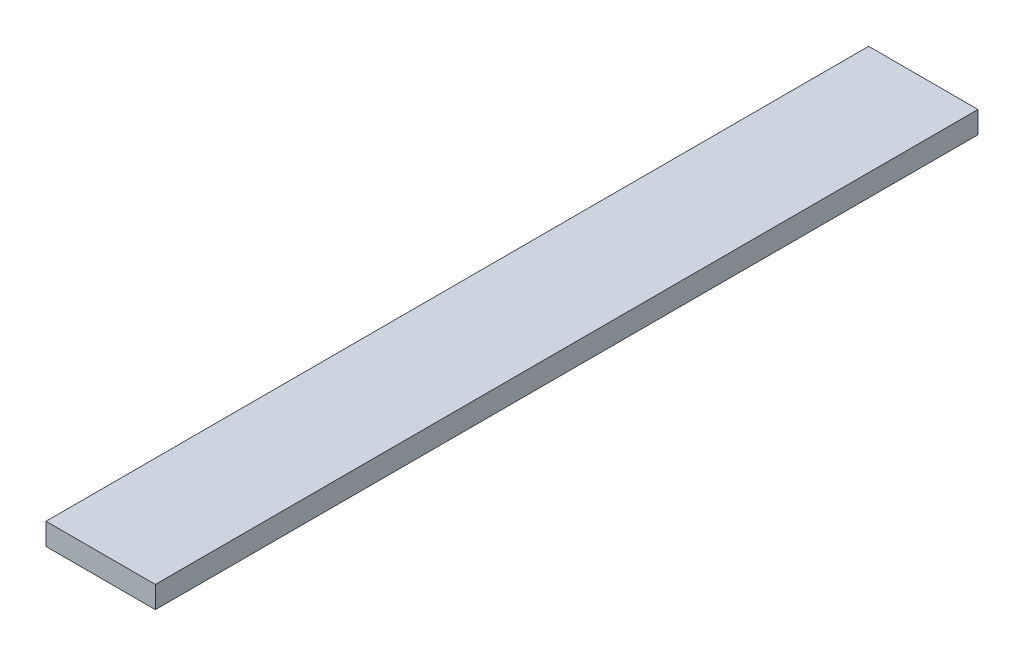
ISO-10303-21;
HEADER;
FILE_DESCRIPTION(('STEP AP214'),'2;1');
FILE_NAME('part.step','',(''),(''),'','','');
FILE_SCHEMA(('AUTOMOTIVE_DESIGN { 1 0 10303 214 1 1 1 1 }'));
ENDSEC;
DATA;
#1=APPLICATION_CONTEXT('core data for automotive mechanical design processes');
#2=APPLICATION_PROTOCOL_DEFINITION('international standard','automotive_design',2000,#1);
#3=PRODUCT_CONTEXT('',#1,'mechanical');
#4=PRODUCT('Part','Part','',(#3));
#5=PRODUCT_RELATED_PRODUCT_CATEGORY('part','',(#4));
#6=PRODUCT_DEFINITION_FORMATION('','',#4);
#7=PRODUCT_DEFINITION_CONTEXT('part definition',#1,'design');
#8=PRODUCT_DEFINITION('design','',#6,#7);
#9=PRODUCT_DEFINITION_SHAPE('','',#8);
#10=(LENGTH_UNIT() NAMED_UNIT(*) SI_UNIT(.MILLI.,.METRE.));
#11=(NAMED_UNIT(*) PLANE_ANGLE_UNIT() SI_UNIT($,.RADIAN.));
#12=(NAMED_UNIT(*) SI_UNIT($,.STERADIAN.) SOLID_ANGLE_UNIT());
#13=UNCERTAINTY_MEASURE_WITH_UNIT(LENGTH_MEASURE(1.E-05),#10,'distance_accuracy_value','');
#14=(GEOMETRIC_REPRESENTATION_CONTEXT(3) GLOBAL_UNCERTAINTY_ASSIGNED_CONTEXT((#13)) GLOBAL_UNIT_ASSIGNED_CONTEXT((#10,
#11,#12)) REPRESENTATION_CONTEXT('',''));
#15=CARTESIAN_POINT('',(0.,0.,0.));
#16=DIRECTION('',(0.,0.,1.));
#17=DIRECTION('',(1.,0.,0.));
#18=AXIS2_PLACEMENT_3D('',#15,#16,#17);
#19=CARTESIAN_POINT('',(0.,1.42999999999,0.));
#20=DIRECTION('',(0.,-1.,0.));
#21=DIRECTION('',(1.,0.,0.));
#22=AXIS2_PLACEMENT_3D('',#19,#20,#21);
#23=PLANE('',#22);
#24=DIRECTION('',(0.,0.,1.));
#25=VECTOR('',#24,1.);
#26=CARTESIAN_POINT('',(2.125,1.42999999999,0.195));
#27=LINE('',#26,#25);
#28=CARTESIAN_POINT('',(2.125,1.42999999999,0.195));
#29=VERTEX_POINT('',#28);
#30=CARTESIAN_POINT('',(2.125,1.42999999999,2.075));
#31=VERTEX_POINT('',#30);
#32=EDGE_CURVE('E80',#29,#31,#27,.T.);
#33=ORIENTED_EDGE('',*,*,#32,.T.);
#34=DIRECTION('',(-1.,0.,0.));
#35=VECTOR('',#34,1.);
#36=CARTESIAN_POINT('',(2.375,1.42999999999,2.075));
#37=LINE('',#36,#35);
#38=CARTESIAN_POINT('',(2.375,1.42999999999,2.075));
#39=VERTEX_POINT('',#38);
#40=EDGE_CURVE('E67',#31,#39,#37,.F.);
#41=ORIENTED_EDGE('',*,*,#40,.T.);
#42=DIRECTION('',(0.,0.,1.));
#43=VECTOR('',#42,1.);
#44=CARTESIAN_POINT('',(2.375,1.42999999999,0.195));
#45=LINE('',#44,#43);
#46=CARTESIAN_POINT('',(2.375,1.42999999999,0.195));
#47=VERTEX_POINT('',#46);
#48=EDGE_CURVE('E54',#39,#47,#45,.F.);
#49=ORIENTED_EDGE('',*,*,#48,.T.);
#50=DIRECTION('',(1.,0.,0.));
#51=VECTOR('',#50,1.);
#52=CARTESIAN_POINT('',(2.375,1.42999999999,0.195));
#53=LINE('',#52,#51);
#54=EDGE_CURVE('E19',#47,#29,#53,.F.);
#55=ORIENTED_EDGE('',*,*,#54,.T.);
#56=EDGE_LOOP('',(#33,#41,#49,#55));
#57=FACE_BOUND('',#56,.T.);
#58=ADVANCED_FACE('F16',(#57),#23,.F.);
#59=CARTESIAN_POINT('',(2.375,1.37999999999,0.195));
#60=DIRECTION('',(0.,0.,1.));
#61=DIRECTION('',(1.,0.,0.));
#62=AXIS2_PLACEMENT_3D('',#59,#60,#61);
#63=PLANE('',#62);
#64=DIRECTION('',(0.,-1.,0.));
#65=VECTOR('',#64,1.);
#66=CARTESIAN_POINT('',(2.375,1.37999999999,0.195));
#67=LINE('',#66,#65);
#68=CARTESIAN_POINT('',(2.375,1.37999999999,0.195));
#69=VERTEX_POINT('',#68);
#70=EDGE_CURVE('E60',#47,#69,#67,.T.);
#71=ORIENTED_EDGE('',*,*,#70,.T.);
#72=DIRECTION('',(1.,0.,0.));
#73=VECTOR('',#72,1.);
#74=CARTESIAN_POINT('',(0.,1.37999999999,0.195));
#75=LINE('',#74,#73);
#76=CARTESIAN_POINT('',(2.125,1.37999999999,0.195));
#77=VERTEX_POINT('',#76);
#78=EDGE_CURVE('E82',#77,#69,#75,.T.);
#79=ORIENTED_EDGE('',*,*,#78,.F.);
#80=DIRECTION('',(0.,1.,0.));
#81=VECTOR('',#80,1.);
#82=CARTESIAN_POINT('',(2.125,1.37999999999,0.195));
#83=LINE('',#82,#81);
#84=EDGE_CURVE('E63',#77,#29,#83,.T.);
#85=ORIENTED_EDGE('',*,*,#84,.T.);
#86=ORIENTED_EDGE('',*,*,#54,.F.);
#87=EDGE_LOOP('',(#71,#79,#85,#86));
#88=FACE_BOUND('',#87,.T.);
#89=ADVANCED_FACE('F59',(#88),#63,.F.);
#90=CARTESIAN_POINT('',(2.375,1.37999999999,0.195));
#91=DIRECTION('',(-1.,0.,0.));
#92=DIRECTION('',(0.,-1.,0.));
#93=AXIS2_PLACEMENT_3D('',#90,#91,#92);
#94=PLANE('',#93);
#95=DIRECTION('',(0.,1.,0.));
#96=VECTOR('',#95,1.);
#97=CARTESIAN_POINT('',(2.375,1.37999999999,2.075));
#98=LINE('',#97,#96);
#99=CARTESIAN_POINT('',(2.375,1.37999999999,2.075));
#100=VERTEX_POINT('',#99);
#101=EDGE_CURVE('E69',#39,#100,#98,.F.);
#102=ORIENTED_EDGE('',*,*,#101,.T.);
#103=DIRECTION('',(0.,0.,1.));
#104=VECTOR('',#103,1.);
#105=CARTESIAN_POINT('',(2.375,1.37999999999,0.));
#106=LINE('',#105,#104);
#107=EDGE_CURVE('E73',#69,#100,#106,.T.);
#108=ORIENTED_EDGE('',*,*,#107,.F.);
#109=ORIENTED_EDGE('',*,*,#70,.F.);
#110=ORIENTED_EDGE('',*,*,#48,.F.);
#111=EDGE_LOOP('',(#102,#108,#109,#110));
#112=FACE_BOUND('',#111,.T.);
#113=ADVANCED_FACE('F71',(#112),#94,.F.);
#114=CARTESIAN_POINT('',(2.375,1.37999999999,2.075));
#115=DIRECTION('',(0.,0.,-1.));
#116=DIRECTION('',(-1.,0.,0.));
#117=AXIS2_PLACEMENT_3D('',#114,#115,#116);
#118=PLANE('',#117);
#119=DIRECTION('',(0.,1.,0.));
#120=VECTOR('',#119,1.);
#121=CARTESIAN_POINT('',(2.125,1.37999999999,2.075));
#122=LINE('',#121,#120);
#123=CARTESIAN_POINT('',(2.125,1.37999999999,2.075));
#124=VERTEX_POINT('',#123);
#125=EDGE_CURVE('E34',#31,#124,#122,.F.);
#126=ORIENTED_EDGE('',*,*,#125,.T.);
#127=DIRECTION('',(1.,0.,0.));
#128=VECTOR('',#127,1.);
#129=CARTESIAN_POINT('',(0.,1.37999999999,2.075));
#130=LINE('',#129,#128);
#131=EDGE_CURVE('E25',#100,#124,#130,.F.);
#132=ORIENTED_EDGE('',*,*,#131,.F.);
#133=ORIENTED_EDGE('',*,*,#101,.F.);
#134=ORIENTED_EDGE('',*,*,#40,.F.);
#135=EDGE_LOOP('',(#126,#132,#133,#134));
#136=FACE_BOUND('',#135,.T.);
#137=ADVANCED_FACE('F88',(#136),#118,.F.);
#138=CARTESIAN_POINT('',(2.125,1.37999999999,0.195));
#139=DIRECTION('',(1.,0.,0.));
#140=DIRECTION('',(0.,1.,0.));
#141=AXIS2_PLACEMENT_3D('',#138,#139,#140);
#142=PLANE('',#141);
#143=ORIENTED_EDGE('',*,*,#84,.F.);
#144=DIRECTION('',(0.,0.,1.));
#145=VECTOR('',#144,1.);
#146=CARTESIAN_POINT('',(2.125,1.37999999999,0.));
#147=LINE('',#146,#145);
#148=EDGE_CURVE('E11',#124,#77,#147,.F.);
#149=ORIENTED_EDGE('',*,*,#148,.F.);
#150=ORIENTED_EDGE('',*,*,#125,.F.);
#151=ORIENTED_EDGE('',*,*,#32,.F.);
#152=EDGE_LOOP('',(#143,#149,#150,#151));
#153=FACE_BOUND('',#152,.T.);
#154=ADVANCED_FACE('F90',(#153),#142,.F.);
#155=CARTESIAN_POINT('',(0.,1.37999999999,0.));
#156=DIRECTION('',(0.,-1.,0.));
#157=DIRECTION('',(1.,0.,0.));
#158=AXIS2_PLACEMENT_3D('',#155,#156,#157);
#159=PLANE('',#158);
#160=ORIENTED_EDGE('',*,*,#131,.T.);
#161=ORIENTED_EDGE('',*,*,#148,.T.);
#162=ORIENTED_EDGE('',*,*,#78,.T.);
#163=ORIENTED_EDGE('',*,*,#107,.T.);
#164=EDGE_LOOP('',(#160,#161,#162,#163));
#165=FACE_BOUND('',#164,.T.);
#166=ADVANCED_FACE('F87',(#165),#159,.T.);
#167=CLOSED_SHELL('',(#58,#89,#113,#137,#154,#166));
#168=MANIFOLD_SOLID_BREP('B1',#167);
#169=ADVANCED_BREP_SHAPE_REPRESENTATION('',(#18,#168),#14);
#170=SHAPE_DEFINITION_REPRESENTATION(#9,#169);
ENDSEC;
END-ISO-10303-21;
